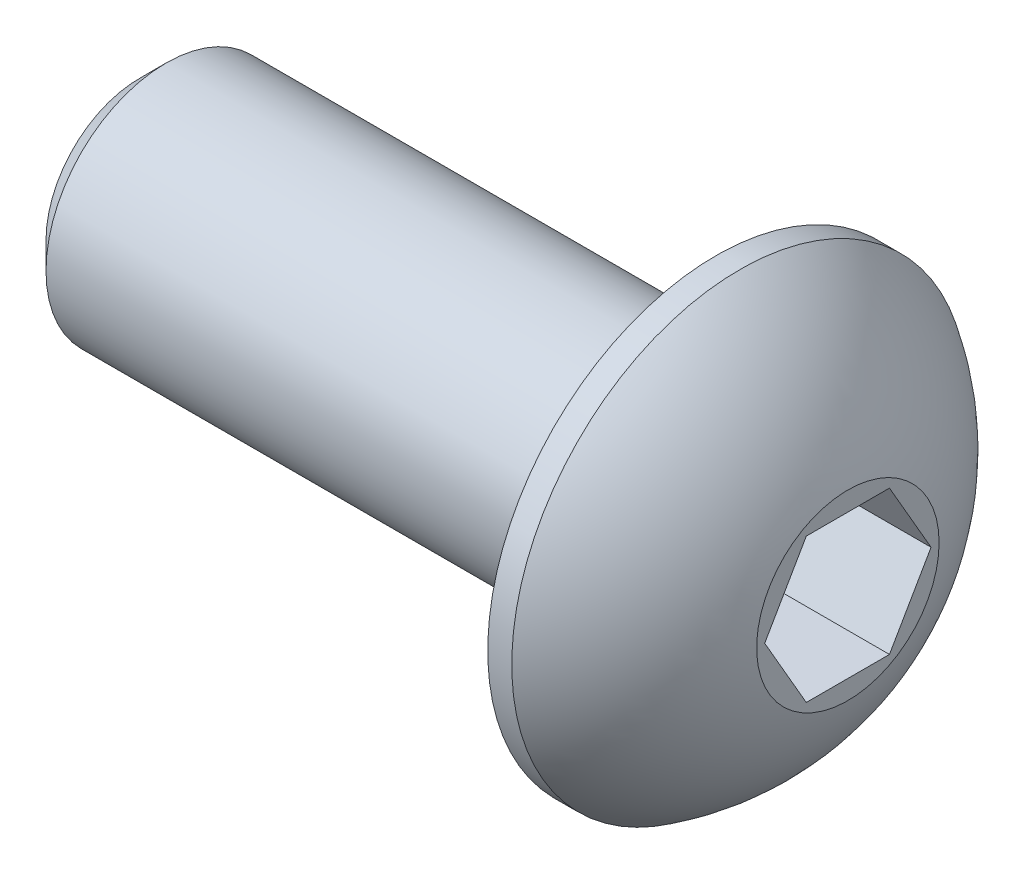
ISO-10303-21;
HEADER;
FILE_DESCRIPTION(('STEP AP214'),'2;1');
FILE_NAME('part.step','',(''),(''),'','','');
FILE_SCHEMA(('AUTOMOTIVE_DESIGN { 1 0 10303 214 1 1 1 1 }'));
ENDSEC;
DATA;
#1=APPLICATION_CONTEXT('core data for automotive mechanical design processes');
#2=APPLICATION_PROTOCOL_DEFINITION('international standard','automotive_design',2000,#1);
#3=PRODUCT_CONTEXT('',#1,'mechanical');
#4=PRODUCT('Part','Part','',(#3));
#5=PRODUCT_RELATED_PRODUCT_CATEGORY('part','',(#4));
#6=PRODUCT_DEFINITION_FORMATION('','',#4);
#7=PRODUCT_DEFINITION_CONTEXT('part definition',#1,'design');
#8=PRODUCT_DEFINITION('design','',#6,#7);
#9=PRODUCT_DEFINITION_SHAPE('','',#8);
#10=(LENGTH_UNIT() NAMED_UNIT(*) SI_UNIT(.MILLI.,.METRE.));
#11=(NAMED_UNIT(*) PLANE_ANGLE_UNIT() SI_UNIT($,.RADIAN.));
#12=(NAMED_UNIT(*) SI_UNIT($,.STERADIAN.) SOLID_ANGLE_UNIT());
#13=UNCERTAINTY_MEASURE_WITH_UNIT(LENGTH_MEASURE(1.E-05),#10,'distance_accuracy_value','');
#14=(GEOMETRIC_REPRESENTATION_CONTEXT(3) GLOBAL_UNCERTAINTY_ASSIGNED_CONTEXT((#13)) GLOBAL_UNIT_ASSIGNED_CONTEXT((#10,
#11,#12)) REPRESENTATION_CONTEXT('',''));
#15=CARTESIAN_POINT('',(0.,0.,0.));
#16=DIRECTION('',(0.,0.,1.));
#17=DIRECTION('',(1.,0.,0.));
#18=AXIS2_PLACEMENT_3D('',#15,#16,#17);
#19=CARTESIAN_POINT('',(2.4,14.6499999995069,9.9));
#20=DIRECTION('',(-1.,0.,0.));
#21=DIRECTION('',(0.,0.,1.));
#22=AXIS2_PLACEMENT_3D('',#19,#20,#21);
#23=PLANE('',#22);
#24=CARTESIAN_POINT('',(2.4,9.9,9.9));
#25=DIRECTION('',(-1.,0.,0.));
#26=DIRECTION('',(0.,0.,1.));
#27=AXIS2_PLACEMENT_3D('',#24,#25,#26);
#28=CIRCLE('',#27,2.84999999995771);
#29=CARTESIAN_POINT('',(2.4,9.9,12.7499999999577));
#30=VERTEX_POINT('',#29);
#31=EDGE_CURVE('E11',#30,#30,#28,.F.);
#32=ORIENTED_EDGE('',*,*,#31,.T.);
#33=EDGE_LOOP('',(#32));
#34=FACE_BOUND('',#33,.T.);
#35=CARTESIAN_POINT('',(2.4,9.9,9.9));
#36=DIRECTION('',(1.,0.,0.));
#37=DIRECTION('',(0.,0.,-1.));
#38=AXIS2_PLACEMENT_3D('',#35,#36,#37);
#39=CIRCLE('',#38,4.74999999950691);
#40=CARTESIAN_POINT('',(2.4,9.9,5.15000000049309));
#41=VERTEX_POINT('',#40);
#42=EDGE_CURVE('E146',#41,#41,#39,.T.);
#43=ORIENTED_EDGE('',*,*,#42,.F.);
#44=EDGE_LOOP('',(#43));
#45=FACE_BOUND('',#44,.T.);
#46=ADVANCED_FACE('F33',(#34,#45),#23,.T.);
#47=CARTESIAN_POINT('',(2.4,9.9,9.9));
#48=DIRECTION('',(1.,0.,0.));
#49=DIRECTION('',(0.,0.,-1.));
#50=AXIS2_PLACEMENT_3D('',#47,#48,#49);
#51=CYLINDRICAL_SURFACE('',#50,4.74999999950691);
#52=ORIENTED_EDGE('',*,*,#42,.T.);
#53=EDGE_LOOP('',(#52));
#54=FACE_BOUND('',#53,.T.);
#55=CARTESIAN_POINT('',(2.89999999940099,9.9,9.9));
#56=DIRECTION('',(1.,0.,0.));
#57=DIRECTION('',(0.,0.,-1.));
#58=AXIS2_PLACEMENT_3D('',#55,#56,#57);
#59=CIRCLE('',#58,4.74999999950691);
#60=CARTESIAN_POINT('',(2.89999999940099,9.9,5.15000000049309));
#61=VERTEX_POINT('',#60);
#62=EDGE_CURVE('E135',#61,#61,#59,.T.);
#63=ORIENTED_EDGE('',*,*,#62,.F.);
#64=EDGE_LOOP('',(#63));
#65=FACE_BOUND('',#64,.T.);
#66=ADVANCED_FACE('F169',(#54,#65),#51,.T.);
#67=CARTESIAN_POINT('',(5.15000000030997,9.9,9.9));
#68=DIRECTION('',(1.,0.,0.));
#69=DIRECTION('',(0.,0.,-1.));
#70=AXIS2_PLACEMENT_3D('',#67,#68,#69);
#71=PLANE('',#70);
#72=DIRECTION('',(0.,-0.866025403784439,0.5));
#73=VECTOR('',#72,1.);
#74=CARTESIAN_POINT('',(5.15000000030997,11.3999999983613,10.7660253971617));
#75=LINE('',#74,#73);
#76=CARTESIAN_POINT('',(5.15000000030997,11.3999999983613,10.7660253971617));
#77=VERTEX_POINT('',#76);
#78=CARTESIAN_POINT('',(5.15000000030997,9.9,11.6320508));
#79=VERTEX_POINT('',#78);
#80=EDGE_CURVE('E48',#77,#79,#75,.T.);
#81=ORIENTED_EDGE('',*,*,#80,.F.);
#82=DIRECTION('',(0.,0.,1.));
#83=VECTOR('',#82,1.);
#84=CARTESIAN_POINT('',(5.15000000030997,11.3999999983613,9.03397458716167));
#85=LINE('',#84,#83);
#86=CARTESIAN_POINT('',(5.15000000030997,11.3999999983613,9.03397458716167));
#87=VERTEX_POINT('',#86);
#88=EDGE_CURVE('E131',#87,#77,#85,.T.);
#89=ORIENTED_EDGE('',*,*,#88,.F.);
#90=DIRECTION('',(0.,0.866025403784438,0.5));
#91=VECTOR('',#90,1.);
#92=CARTESIAN_POINT('',(5.15000000030997,9.9,8.16794918432334));
#93=LINE('',#92,#91);
#94=CARTESIAN_POINT('',(5.15000000030997,9.9,8.16794918432334));
#95=VERTEX_POINT('',#94);
#96=EDGE_CURVE('E129',#95,#87,#93,.T.);
#97=ORIENTED_EDGE('',*,*,#96,.F.);
#98=DIRECTION('',(0.,0.866025403784438,-0.5));
#99=VECTOR('',#98,1.);
#100=CARTESIAN_POINT('',(5.15000000030997,8.40000000163871,9.03397458716167));
#101=LINE('',#100,#99);
#102=CARTESIAN_POINT('',(5.15000000030997,8.40000000163871,9.03397458716167));
#103=VERTEX_POINT('',#102);
#104=EDGE_CURVE('E96',#103,#95,#101,.T.);
#105=ORIENTED_EDGE('',*,*,#104,.F.);
#106=DIRECTION('',(0.,0.,-1.));
#107=VECTOR('',#106,1.);
#108=CARTESIAN_POINT('',(5.15000000030997,8.40000000163871,10.7660253971617));
#109=LINE('',#108,#107);
#110=CARTESIAN_POINT('',(5.15000000030997,8.40000000163871,10.7660253971617));
#111=VERTEX_POINT('',#110);
#112=EDGE_CURVE('E125',#111,#103,#109,.T.);
#113=ORIENTED_EDGE('',*,*,#112,.F.);
#114=DIRECTION('',(0.,-0.866025403784439,-0.5));
#115=VECTOR('',#114,1.);
#116=CARTESIAN_POINT('',(5.15000000030997,9.9,11.6320508));
#117=LINE('',#116,#115);
#118=EDGE_CURVE('E122',#79,#111,#117,.T.);
#119=ORIENTED_EDGE('',*,*,#118,.F.);
#120=EDGE_LOOP('',(#81,#89,#97,#105,#113,#119));
#121=FACE_BOUND('',#120,.T.);
#122=CARTESIAN_POINT('',(5.15000000030997,9.9,9.9));
#123=DIRECTION('',(1.,0.,0.));
#124=DIRECTION('',(0.,0.,-1.));
#125=AXIS2_PLACEMENT_3D('',#122,#123,#124);
#126=CIRCLE('',#125,1.90000000024469);
#127=CARTESIAN_POINT('',(5.15000000030997,9.9,7.99999999975531));
#128=VERTEX_POINT('',#127);
#129=EDGE_CURVE('E143',#128,#128,#126,.T.);
#130=ORIENTED_EDGE('',*,*,#129,.T.);
#131=EDGE_LOOP('',(#130));
#132=FACE_BOUND('',#131,.T.);
#133=ADVANCED_FACE('F175',(#121,#132),#71,.T.);
#134=CARTESIAN_POINT('',(0.200457880109379,9.9,9.9));
#135=DIRECTION('',(1.,0.,0.));
#136=DIRECTION('',(0.,0.,-1.));
#137=AXIS2_PLACEMENT_3D('',#134,#135,#136);
#138=DEGENERATE_TOROIDAL_SURFACE('',#137,0.305624640180089,5.19999999888662,.T.);
#139=ORIENTED_EDGE('',*,*,#62,.T.);
#140=EDGE_LOOP('',(#139));
#141=FACE_BOUND('',#140,.T.);
#142=ORIENTED_EDGE('',*,*,#129,.F.);
#143=EDGE_LOOP('',(#142));
#144=FACE_BOUND('',#143,.T.);
#145=ADVANCED_FACE('F182',(#141,#144),#138,.T.);
#146=CARTESIAN_POINT('',(-9.6,9.9,9.9));
#147=DIRECTION('',(1.,0.,0.));
#148=DIRECTION('',(0.,0.,-1.));
#149=AXIS2_PLACEMENT_3D('',#146,#147,#148);
#150=CYLINDRICAL_SURFACE('',#149,2.5);
#151=CARTESIAN_POINT('',(1.79999999999941,9.9,9.9));
#152=DIRECTION('',(-1.,0.,0.));
#153=DIRECTION('',(0.,0.,1.));
#154=AXIS2_PLACEMENT_3D('',#151,#152,#153);
#155=CIRCLE('',#154,2.5);
#156=CARTESIAN_POINT('',(1.79999999999941,9.9,12.4));
#157=VERTEX_POINT('',#156);
#158=EDGE_CURVE('E41',#157,#157,#155,.T.);
#159=ORIENTED_EDGE('',*,*,#158,.T.);
#160=EDGE_LOOP('',(#159));
#161=FACE_BOUND('',#160,.T.);
#162=CARTESIAN_POINT('',(-9.05000000001423,9.9,9.9));
#163=DIRECTION('',(-1.,0.,0.));
#164=DIRECTION('',(0.,0.,1.));
#165=AXIS2_PLACEMENT_3D('',#162,#163,#164);
#166=CIRCLE('',#165,2.5);
#167=CARTESIAN_POINT('',(-9.05000000001423,9.9,12.4));
#168=VERTEX_POINT('',#167);
#169=EDGE_CURVE('E152',#168,#168,#166,.F.);
#170=ORIENTED_EDGE('',*,*,#169,.T.);
#171=EDGE_LOOP('',(#170));
#172=FACE_BOUND('',#171,.T.);
#173=ADVANCED_FACE('F157',(#161,#172),#150,.T.);
#174=CARTESIAN_POINT('',(-9.6,9.9,9.9));
#175=DIRECTION('',(-1.,0.,0.));
#176=DIRECTION('',(0.,0.,1.));
#177=AXIS2_PLACEMENT_3D('',#174,#175,#176);
#178=PLANE('',#177);
#179=CARTESIAN_POINT('',(-9.6,9.9,9.9));
#180=DIRECTION('',(-1.,0.,0.));
#181=DIRECTION('',(0.,0.,1.));
#182=AXIS2_PLACEMENT_3D('',#179,#180,#181);
#183=CIRCLE('',#182,1.95000000001424);
#184=CARTESIAN_POINT('',(-9.6,9.9,11.8500000000142));
#185=VERTEX_POINT('',#184);
#186=EDGE_CURVE('E149',#185,#185,#183,.T.);
#187=ORIENTED_EDGE('',*,*,#186,.T.);
#188=EDGE_LOOP('',(#187));
#189=FACE_BOUND('',#188,.T.);
#190=ADVANCED_FACE('F189',(#189),#178,.T.);
#191=CARTESIAN_POINT('',(2.95000000030997,11.3999999983613,10.7660253971617));
#192=DIRECTION('',(0.,0.5,0.866025403784439));
#193=DIRECTION('',(0.,-0.866025403784439,0.5));
#194=AXIS2_PLACEMENT_3D('',#191,#192,#193);
#195=PLANE('',#194);
#196=ORIENTED_EDGE('',*,*,#80,.T.);
#197=DIRECTION('',(1.,0.,0.));
#198=VECTOR('',#197,1.);
#199=CARTESIAN_POINT('',(2.95000000030997,9.9,11.6320508));
#200=LINE('',#199,#198);
#201=CARTESIAN_POINT('',(2.95000000030997,9.9,11.6320508));
#202=VERTEX_POINT('',#201);
#203=EDGE_CURVE('E78',#202,#79,#200,.T.);
#204=ORIENTED_EDGE('',*,*,#203,.F.);
#205=DIRECTION('',(0.,-0.866025403784439,0.5));
#206=VECTOR('',#205,1.);
#207=CARTESIAN_POINT('',(2.95000000030997,11.3999999983613,10.7660253971617));
#208=LINE('',#207,#206);
#209=CARTESIAN_POINT('',(2.95000000030997,11.3999999983613,10.7660253971617));
#210=VERTEX_POINT('',#209);
#211=EDGE_CURVE('E133',#210,#202,#208,.T.);
#212=ORIENTED_EDGE('',*,*,#211,.F.);
#213=DIRECTION('',(1.,0.,0.));
#214=VECTOR('',#213,1.);
#215=CARTESIAN_POINT('',(2.95000000030997,11.3999999983613,10.7660253971617));
#216=LINE('',#215,#214);
#217=EDGE_CURVE('E56',#210,#77,#216,.T.);
#218=ORIENTED_EDGE('',*,*,#217,.T.);
#219=EDGE_LOOP('',(#196,#204,#212,#218));
#220=FACE_BOUND('',#219,.T.);
#221=ADVANCED_FACE('F192',(#220),#195,.F.);
#222=CARTESIAN_POINT('',(2.95000000030997,11.3999999983613,9.03397458716167));
#223=DIRECTION('',(0.,1.,0.));
#224=DIRECTION('',(0.,0.,1.));
#225=AXIS2_PLACEMENT_3D('',#222,#223,#224);
#226=PLANE('',#225);
#227=ORIENTED_EDGE('',*,*,#88,.T.);
#228=ORIENTED_EDGE('',*,*,#217,.F.);
#229=DIRECTION('',(0.,0.,1.));
#230=VECTOR('',#229,1.);
#231=CARTESIAN_POINT('',(2.95000000030997,11.3999999983613,9.03397458716167));
#232=LINE('',#231,#230);
#233=CARTESIAN_POINT('',(2.95000000030997,11.3999999983613,9.03397458716167));
#234=VERTEX_POINT('',#233);
#235=EDGE_CURVE('E108',#234,#210,#232,.T.);
#236=ORIENTED_EDGE('',*,*,#235,.F.);
#237=DIRECTION('',(1.,0.,0.));
#238=VECTOR('',#237,1.);
#239=CARTESIAN_POINT('',(2.95000000030997,11.3999999983613,9.03397458716167));
#240=LINE('',#239,#238);
#241=EDGE_CURVE('E100',#234,#87,#240,.T.);
#242=ORIENTED_EDGE('',*,*,#241,.T.);
#243=EDGE_LOOP('',(#227,#228,#236,#242));
#244=FACE_BOUND('',#243,.T.);
#245=ADVANCED_FACE('F196',(#244),#226,.F.);
#246=CARTESIAN_POINT('',(2.95000000030997,9.9,8.16794918432334));
#247=DIRECTION('',(0.,0.500000000000001,-0.866025403784438));
#248=DIRECTION('',(0.,0.866025403784438,0.500000000000001));
#249=AXIS2_PLACEMENT_3D('',#246,#247,#248);
#250=PLANE('',#249);
#251=ORIENTED_EDGE('',*,*,#96,.T.);
#252=ORIENTED_EDGE('',*,*,#241,.F.);
#253=DIRECTION('',(0.,0.866025403784438,0.5));
#254=VECTOR('',#253,1.);
#255=CARTESIAN_POINT('',(2.95000000030997,9.9,8.16794918432334));
#256=LINE('',#255,#254);
#257=CARTESIAN_POINT('',(2.95000000030997,9.9,8.16794918432334));
#258=VERTEX_POINT('',#257);
#259=EDGE_CURVE('E104',#258,#234,#256,.T.);
#260=ORIENTED_EDGE('',*,*,#259,.F.);
#261=DIRECTION('',(1.,0.,0.));
#262=VECTOR('',#261,1.);
#263=CARTESIAN_POINT('',(2.95000000030997,9.9,8.16794918432334));
#264=LINE('',#263,#262);
#265=EDGE_CURVE('E89',#258,#95,#264,.T.);
#266=ORIENTED_EDGE('',*,*,#265,.T.);
#267=EDGE_LOOP('',(#251,#252,#260,#266));
#268=FACE_BOUND('',#267,.T.);
#269=ADVANCED_FACE('F105',(#268),#250,.F.);
#270=CARTESIAN_POINT('',(2.95000000030997,8.40000000163871,9.03397458716167));
#271=DIRECTION('',(0.,-0.500000000000001,-0.866025403784438));
#272=DIRECTION('',(0.,0.866025403784438,-0.500000000000001));
#273=AXIS2_PLACEMENT_3D('',#270,#271,#272);
#274=PLANE('',#273);
#275=ORIENTED_EDGE('',*,*,#104,.T.);
#276=ORIENTED_EDGE('',*,*,#265,.F.);
#277=DIRECTION('',(0.,0.866025403784438,-0.5));
#278=VECTOR('',#277,1.);
#279=CARTESIAN_POINT('',(2.95000000030997,8.40000000163871,9.03397458716167));
#280=LINE('',#279,#278);
#281=CARTESIAN_POINT('',(2.95000000030997,8.40000000163871,9.03397458716167));
#282=VERTEX_POINT('',#281);
#283=EDGE_CURVE('E93',#282,#258,#280,.T.);
#284=ORIENTED_EDGE('',*,*,#283,.F.);
#285=DIRECTION('',(1.,0.,0.));
#286=VECTOR('',#285,1.);
#287=CARTESIAN_POINT('',(2.95000000030997,8.40000000163871,9.03397458716167));
#288=LINE('',#287,#286);
#289=EDGE_CURVE('E101',#282,#103,#288,.T.);
#290=ORIENTED_EDGE('',*,*,#289,.T.);
#291=EDGE_LOOP('',(#275,#276,#284,#290));
#292=FACE_BOUND('',#291,.T.);
#293=ADVANCED_FACE('F91',(#292),#274,.F.);
#294=CARTESIAN_POINT('',(2.95000000030997,8.40000000163871,10.7660253971617));
#295=DIRECTION('',(0.,-1.,0.));
#296=DIRECTION('',(0.,0.,-1.));
#297=AXIS2_PLACEMENT_3D('',#294,#295,#296);
#298=PLANE('',#297);
#299=ORIENTED_EDGE('',*,*,#112,.T.);
#300=ORIENTED_EDGE('',*,*,#289,.F.);
#301=DIRECTION('',(0.,0.,-1.));
#302=VECTOR('',#301,1.);
#303=CARTESIAN_POINT('',(2.95000000030997,8.40000000163871,10.7660253971617));
#304=LINE('',#303,#302);
#305=CARTESIAN_POINT('',(2.95000000030997,8.40000000163871,10.7660253971617));
#306=VERTEX_POINT('',#305);
#307=EDGE_CURVE('E114',#306,#282,#304,.T.);
#308=ORIENTED_EDGE('',*,*,#307,.F.);
#309=DIRECTION('',(1.,0.,0.));
#310=VECTOR('',#309,1.);
#311=CARTESIAN_POINT('',(2.95000000030997,8.40000000163871,10.7660253971617));
#312=LINE('',#311,#310);
#313=EDGE_CURVE('E138',#306,#111,#312,.T.);
#314=ORIENTED_EDGE('',*,*,#313,.T.);
#315=EDGE_LOOP('',(#299,#300,#308,#314));
#316=FACE_BOUND('',#315,.T.);
#317=ADVANCED_FACE('F200',(#316),#298,.F.);
#318=CARTESIAN_POINT('',(2.95000000030997,9.9,11.6320508));
#319=DIRECTION('',(0.,-0.5,0.866025403784439));
#320=DIRECTION('',(0.,-0.866025403784439,-0.5));
#321=AXIS2_PLACEMENT_3D('',#318,#319,#320);
#322=PLANE('',#321);
#323=ORIENTED_EDGE('',*,*,#118,.T.);
#324=ORIENTED_EDGE('',*,*,#313,.F.);
#325=DIRECTION('',(0.,-0.866025403784439,-0.5));
#326=VECTOR('',#325,1.);
#327=CARTESIAN_POINT('',(2.95000000030997,9.9,11.6320508));
#328=LINE('',#327,#326);
#329=EDGE_CURVE('E116',#202,#306,#328,.T.);
#330=ORIENTED_EDGE('',*,*,#329,.F.);
#331=ORIENTED_EDGE('',*,*,#203,.T.);
#332=EDGE_LOOP('',(#323,#324,#330,#331));
#333=FACE_BOUND('',#332,.T.);
#334=ADVANCED_FACE('F197',(#333),#322,.F.);
#335=CARTESIAN_POINT('',(2.95000000030997,0.,0.));
#336=DIRECTION('',(1.,0.,0.));
#337=DIRECTION('',(0.,0.,-1.));
#338=AXIS2_PLACEMENT_3D('',#335,#336,#337);
#339=PLANE('',#338);
#340=ORIENTED_EDGE('',*,*,#211,.T.);
#341=ORIENTED_EDGE('',*,*,#329,.T.);
#342=ORIENTED_EDGE('',*,*,#307,.T.);
#343=ORIENTED_EDGE('',*,*,#283,.T.);
#344=ORIENTED_EDGE('',*,*,#259,.T.);
#345=ORIENTED_EDGE('',*,*,#235,.T.);
#346=EDGE_LOOP('',(#340,#341,#342,#343,#344,#345));
#347=FACE_BOUND('',#346,.T.);
#348=ADVANCED_FACE('F111',(#347),#339,.T.);
#349=CARTESIAN_POINT('',(-9.6,9.9,9.9));
#350=DIRECTION('',(1.,0.,0.));
#351=DIRECTION('',(0.,0.,-1.));
#352=AXIS2_PLACEMENT_3D('',#349,#350,#351);
#353=CONICAL_SURFACE('',#352,1.95000000001424,0.785398163397445);
#354=ORIENTED_EDGE('',*,*,#169,.F.);
#355=EDGE_LOOP('',(#354));
#356=FACE_BOUND('',#355,.T.);
#357=ORIENTED_EDGE('',*,*,#186,.F.);
#358=EDGE_LOOP('',(#357));
#359=FACE_BOUND('',#358,.T.);
#360=ADVANCED_FACE('F161',(#356,#359),#353,.T.);
#361=CARTESIAN_POINT('',(1.79999999999941,9.9,9.9));
#362=DIRECTION('',(1.,0.,0.));
#363=DIRECTION('',(0.,0.,-1.));
#364=AXIS2_PLACEMENT_3D('',#361,#362,#363);
#365=CONICAL_SURFACE('',#364,2.5,0.528074448373343);
#366=ORIENTED_EDGE('',*,*,#31,.F.);
#367=EDGE_LOOP('',(#366));
#368=FACE_BOUND('',#367,.T.);
#369=ORIENTED_EDGE('',*,*,#158,.F.);
#370=EDGE_LOOP('',(#369));
#371=FACE_BOUND('',#370,.T.);
#372=ADVANCED_FACE('F35',(#368,#371),#365,.T.);
#373=CLOSED_SHELL('',(#46,#66,#133,#145,#173,#190,#221,#245,#269,#293,#317,#334,#348,#360,#372));
#374=MANIFOLD_SOLID_BREP('B2',#373);
#375=ADVANCED_BREP_SHAPE_REPRESENTATION('',(#18,#374),#14);
#376=SHAPE_DEFINITION_REPRESENTATION(#9,#375);
ENDSEC;
END-ISO-10303-21;
